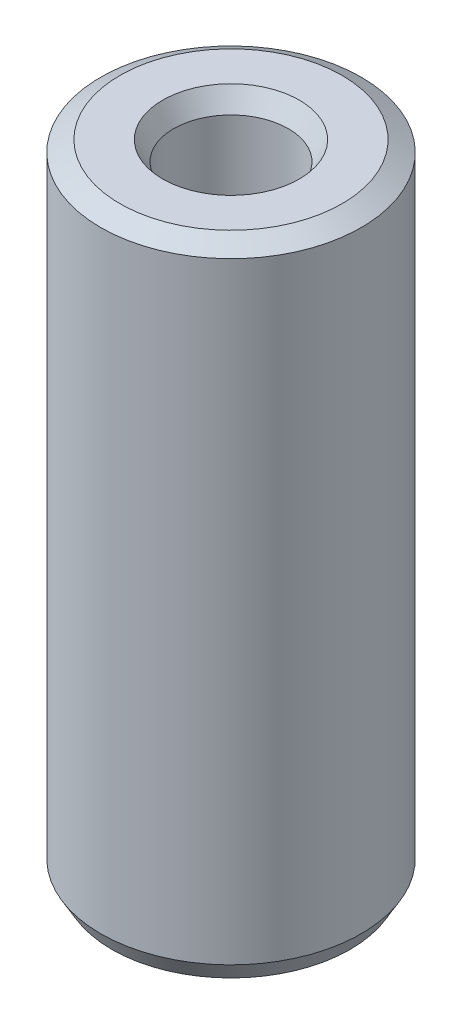
ISO-10303-21;
HEADER;
FILE_DESCRIPTION(('STEP AP214'),'2;1');
FILE_NAME('part.step','',(''),(''),'','','');
FILE_SCHEMA(('AUTOMOTIVE_DESIGN { 1 0 10303 214 1 1 1 1 }'));
ENDSEC;
DATA;
#1=APPLICATION_CONTEXT('core data for automotive mechanical design processes');
#2=APPLICATION_PROTOCOL_DEFINITION('international standard','automotive_design',2000,#1);
#3=PRODUCT_CONTEXT('',#1,'mechanical');
#4=PRODUCT('Part','Part','',(#3));
#5=PRODUCT_RELATED_PRODUCT_CATEGORY('part','',(#4));
#6=PRODUCT_DEFINITION_FORMATION('','',#4);
#7=PRODUCT_DEFINITION_CONTEXT('part definition',#1,'design');
#8=PRODUCT_DEFINITION('design','',#6,#7);
#9=PRODUCT_DEFINITION_SHAPE('','',#8);
#10=(LENGTH_UNIT() NAMED_UNIT(*) SI_UNIT(.MILLI.,.METRE.));
#11=(NAMED_UNIT(*) PLANE_ANGLE_UNIT() SI_UNIT($,.RADIAN.));
#12=(NAMED_UNIT(*) SI_UNIT($,.STERADIAN.) SOLID_ANGLE_UNIT());
#13=UNCERTAINTY_MEASURE_WITH_UNIT(LENGTH_MEASURE(1.E-05),#10,'distance_accuracy_value','');
#14=(GEOMETRIC_REPRESENTATION_CONTEXT(3) GLOBAL_UNCERTAINTY_ASSIGNED_CONTEXT((#13)) GLOBAL_UNIT_ASSIGNED_CONTEXT((#10,
#11,#12)) REPRESENTATION_CONTEXT('',''));
#15=CARTESIAN_POINT('',(0.,0.,0.));
#16=DIRECTION('',(0.,0.,1.));
#17=DIRECTION('',(1.,0.,0.));
#18=AXIS2_PLACEMENT_3D('',#15,#16,#17);
#19=CARTESIAN_POINT('',(0.,197.049070375848,0.));
#20=DIRECTION('',(0.,-1.,0.));
#21=DIRECTION('',(0.,0.,-1.));
#22=AXIS2_PLACEMENT_3D('',#19,#20,#21);
#23=CYLINDRICAL_SURFACE('',#22,40.);
#24=CARTESIAN_POINT('',(0.,5.88731716795488,0.));
#25=DIRECTION('',(0.,1.,0.));
#26=DIRECTION('',(0.,0.,1.));
#27=AXIS2_PLACEMENT_3D('',#24,#25,#26);
#28=CIRCLE('',#27,40.);
#29=CARTESIAN_POINT('',(0.,5.88731716795485,-40.));
#30=VERTEX_POINT('',#29);
#31=EDGE_CURVE('E10',#30,#30,#28,.T.);
#32=CARTESIAN_POINT('',(0.,193.650026224125,0.));
#33=DIRECTION('',(0.,1.,0.));
#34=DIRECTION('',(0.,0.,1.));
#35=AXIS2_PLACEMENT_3D('',#32,#33,#34);
#36=CIRCLE('',#35,40.);
#37=CARTESIAN_POINT('',(0.,193.650026224125,-40.));
#38=VERTEX_POINT('',#37);
#39=EDGE_CURVE('E50',#38,#38,#36,.F.);
#40=CARTESIAN_POINT('',(0.,5.88731716795485,-40.));
#41=CARTESIAN_POINT('',(0.,7.84317872062329,-40.));
#42=CARTESIAN_POINT('',(0.,9.79904027329173,-40.));
#43=CARTESIAN_POINT('',(0.,13.7107633786286,-40.));
#44=CARTESIAN_POINT('',(0.,15.6666249312971,-40.));
#45=CARTESIAN_POINT('',(0.,19.5783480366339,-40.));
#46=CARTESIAN_POINT('',(0.,21.5342095893024,-40.));
#47=CARTESIAN_POINT('',(0.,25.4459326946393,-40.));
#48=CARTESIAN_POINT('',(0.,27.4017942473077,-40.));
#49=CARTESIAN_POINT('',(0.,31.3135173526446,-40.));
#50=CARTESIAN_POINT('',(0.,33.269378905313,-40.));
#51=CARTESIAN_POINT('',(0.,37.1811020106499,-40.));
#52=CARTESIAN_POINT('',(0.,39.1369635633184,-40.));
#53=CARTESIAN_POINT('',(0.,43.0486866686552,-40.));
#54=CARTESIAN_POINT('',(0.,45.0045482213237,-40.));
#55=CARTESIAN_POINT('',(0.,48.9162713266605,-40.));
#56=CARTESIAN_POINT('',(0.,50.872132879329,-40.));
#57=CARTESIAN_POINT('',(0.,54.7838559846659,-40.));
#58=CARTESIAN_POINT('',(0.,56.7397175373343,-40.));
#59=CARTESIAN_POINT('',(0.,60.6514406426712,-40.));
#60=CARTESIAN_POINT('',(0.,62.6073021953396,-40.));
#61=CARTESIAN_POINT('',(0.,66.5190253006765,-40.));
#62=CARTESIAN_POINT('',(0.,68.474886853345,-40.));
#63=CARTESIAN_POINT('',(0.,72.3866099586818,-40.));
#64=CARTESIAN_POINT('',(0.,74.3424715113503,-40.));
#65=CARTESIAN_POINT('',(0.,78.2541946166872,-40.));
#66=CARTESIAN_POINT('',(0.,80.2100561693556,-40.));
#67=CARTESIAN_POINT('',(0.,84.1217792746925,-40.));
#68=CARTESIAN_POINT('',(0.,86.0776408273609,-40.));
#69=CARTESIAN_POINT('',(0.,89.9893639326978,-40.));
#70=CARTESIAN_POINT('',(0.,91.9452254853662,-40.));
#71=CARTESIAN_POINT('',(0.,95.8569485907031,-40.));
#72=CARTESIAN_POINT('',(0.,97.8128101433716,-40.));
#73=CARTESIAN_POINT('',(0.,101.724533248708,-40.));
#74=CARTESIAN_POINT('',(0.,103.680394801377,-40.));
#75=CARTESIAN_POINT('',(0.,107.592117906714,-40.));
#76=CARTESIAN_POINT('',(0.,109.547979459382,-40.));
#77=CARTESIAN_POINT('',(0.,113.459702564719,-40.));
#78=CARTESIAN_POINT('',(0.,115.415564117388,-40.));
#79=CARTESIAN_POINT('',(0.,119.327287222724,-40.));
#80=CARTESIAN_POINT('',(0.,121.283148775393,-40.));
#81=CARTESIAN_POINT('',(0.,125.19487188073,-40.));
#82=CARTESIAN_POINT('',(0.,127.150733433398,-40.));
#83=CARTESIAN_POINT('',(0.,131.062456538735,-40.));
#84=CARTESIAN_POINT('',(0.,133.018318091404,-40.));
#85=CARTESIAN_POINT('',(0.,136.93004119674,-40.));
#86=CARTESIAN_POINT('',(0.,138.885902749409,-40.));
#87=CARTESIAN_POINT('',(0.,142.797625854746,-40.));
#88=CARTESIAN_POINT('',(0.,144.753487407414,-40.));
#89=CARTESIAN_POINT('',(0.,148.665210512751,-40.));
#90=CARTESIAN_POINT('',(0.,150.621072065419,-40.));
#91=CARTESIAN_POINT('',(0.,154.532795170756,-40.));
#92=CARTESIAN_POINT('',(0.,156.488656723425,-40.));
#93=CARTESIAN_POINT('',(0.,160.400379828762,-40.));
#94=CARTESIAN_POINT('',(0.,162.35624138143,-40.));
#95=CARTESIAN_POINT('',(0.,166.267964486767,-40.));
#96=CARTESIAN_POINT('',(0.,168.223826039435,-40.));
#97=CARTESIAN_POINT('',(0.,172.135549144772,-40.));
#98=CARTESIAN_POINT('',(0.,174.091410697441,-40.));
#99=CARTESIAN_POINT('',(0.,178.003133802778,-40.));
#100=CARTESIAN_POINT('',(0.,179.958995355446,-40.));
#101=CARTESIAN_POINT('',(0.,183.870718460783,-40.));
#102=CARTESIAN_POINT('',(0.,185.826580013451,-40.));
#103=CARTESIAN_POINT('',(0.,189.738303118788,-40.));
#104=CARTESIAN_POINT('',(0.,191.694164671457,-40.));
#105=CARTESIAN_POINT('',(0.,193.650026224125,-40.));
#106=B_SPLINE_CURVE_WITH_KNOTS('',3,(#40,#41,#42,#43,#44,#45,#46,#47,#48,#49,#50,#51,#52,#53,
#54,#55,#56,#57,#58,#59,#60,#61,#62,#63,#64,#65,#66,#67,#68,#69,#70,#71,#72,#73,#74,#75,#76,#77,
#78,#79,#80,#81,#82,#83,#84,#85,#86,#87,#88,#89,#90,#91,#92,#93,#94,#95,#96,#97,#98,#99,#100,
#101,#102,#103,#104,#105),.UNSPECIFIED.,.F.,.F.,(4,2,2,2,2,2,2,2,2,2,2,2,2,2,2,2,2,2,2,2,2,2,2,
2,2,2,2,2,2,2,2,2,4),(0.,5.86758465800533,11.7351693160107,17.602753974016,23.4703386320213,
29.3379232900266,35.205507948032,41.0730926060373,46.9406772640426,52.8082619220479,
58.6758465800532,64.5434312380586,70.4110158960639,76.2786005540692,82.1461852120745,
88.0137698700798,93.8813545280852,99.7489391860905,105.616523844096,111.484108502101,
117.351693160106,123.219277818112,129.086862476117,134.954447134122,140.822031792128,
146.689616450133,152.557201108138,158.424785766144,164.292370424149,170.159955082154,
176.02753974016,181.895124398165,187.76270905617),.UNSPECIFIED.);
#107=EDGE_CURVE('BSEAM39',#30,#38,#106,.T.);
#108=ORIENTED_EDGE('',*,*,#31,.T.);
#109=ORIENTED_EDGE('',*,*,#39,.T.);
#110=ORIENTED_EDGE('',*,*,#107,.T.);
#111=ORIENTED_EDGE('',*,*,#107,.F.);
#112=EDGE_LOOP('',(#108,#110,#109,#111));
#113=FACE_BOUND('',#112,.T.);
#114=ADVANCED_FACE('F39',(#113),#23,.T.);
#115=CARTESIAN_POINT('',(0.,197.049070375848,0.));
#116=DIRECTION('',(0.,1.,0.));
#117=DIRECTION('',(0.,0.,1.));
#118=AXIS2_PLACEMENT_3D('',#115,#116,#117);
#119=PLANE('',#118);
#120=CARTESIAN_POINT('',(0.,197.049070375848,0.));
#121=DIRECTION('',(0.,1.,0.));
#122=DIRECTION('',(0.,0.,1.));
#123=AXIS2_PLACEMENT_3D('',#120,#121,#122);
#124=CIRCLE('',#123,20.9928139128867);
#125=CARTESIAN_POINT('',(0.,197.049070375848,20.9928139128867));
#126=VERTEX_POINT('',#125);
#127=EDGE_CURVE('E58',#126,#126,#124,.F.);
#128=ORIENTED_EDGE('',*,*,#127,.T.);
#129=EDGE_LOOP('',(#128));
#130=FACE_BOUND('',#129,.T.);
#131=CARTESIAN_POINT('',(0.,197.049070375848,0.));
#132=DIRECTION('',(0.,1.,0.));
#133=DIRECTION('',(0.,0.,1.));
#134=AXIS2_PLACEMENT_3D('',#131,#132,#133);
#135=CIRCLE('',#134,34.1126828320455);
#136=CARTESIAN_POINT('',(0.,197.049070375848,-34.1126828320455));
#137=VERTEX_POINT('',#136);
#138=EDGE_CURVE('E61',#137,#137,#135,.T.);
#139=ORIENTED_EDGE('',*,*,#138,.T.);
#140=EDGE_LOOP('',(#139));
#141=FACE_BOUND('',#140,.T.);
#142=ADVANCED_FACE('F88',(#130,#141),#119,.T.);
#143=CARTESIAN_POINT('',(0.,0.,0.));
#144=DIRECTION('',(0.,1.,0.));
#145=DIRECTION('',(0.,0.,1.));
#146=AXIS2_PLACEMENT_3D('',#143,#144,#145);
#147=PLANE('',#146);
#148=CARTESIAN_POINT('',(0.,0.,0.));
#149=DIRECTION('',(0.,1.,0.));
#150=DIRECTION('',(0.,0.,1.));
#151=AXIS2_PLACEMENT_3D('',#148,#149,#150);
#152=CIRCLE('',#151,23.4810869291178);
#153=CARTESIAN_POINT('',(0.,0.,23.4810869291178));
#154=VERTEX_POINT('',#153);
#155=EDGE_CURVE('E51',#154,#154,#152,.T.);
#156=ORIENTED_EDGE('',*,*,#155,.T.);
#157=EDGE_LOOP('',(#156));
#158=FACE_BOUND('',#157,.T.);
#159=CARTESIAN_POINT('',(0.,0.,0.));
#160=DIRECTION('',(0.,1.,0.));
#161=DIRECTION('',(0.,0.,1.));
#162=AXIS2_PLACEMENT_3D('',#159,#160,#161);
#163=CIRCLE('',#162,36.6009558482765);
#164=CARTESIAN_POINT('',(0.,0.,36.6009558482765));
#165=VERTEX_POINT('',#164);
#166=EDGE_CURVE('E54',#165,#165,#163,.F.);
#167=ORIENTED_EDGE('',*,*,#166,.T.);
#168=EDGE_LOOP('',(#167));
#169=FACE_BOUND('',#168,.T.);
#170=ADVANCED_FACE('F83',(#158,#169),#147,.F.);
#171=CARTESIAN_POINT('',(0.,197.049070375848,0.));
#172=DIRECTION('',(0.,-1.,0.));
#173=DIRECTION('',(0.,0.,-1.));
#174=AXIS2_PLACEMENT_3D('',#171,#172,#173);
#175=CYLINDRICAL_SURFACE('',#174,17.5937697611632);
#176=CARTESIAN_POINT('',(0.,191.161753207894,0.));
#177=DIRECTION('',(0.,1.,0.));
#178=DIRECTION('',(0.,0.,1.));
#179=AXIS2_PLACEMENT_3D('',#176,#177,#178);
#180=CIRCLE('',#179,17.5937697611632);
#181=CARTESIAN_POINT('',(0.,191.161753207894,-17.5937697611632));
#182=VERTEX_POINT('',#181);
#183=EDGE_CURVE('E67',#182,#182,#180,.T.);
#184=CARTESIAN_POINT('',(0.,3.39904415172332,0.));
#185=DIRECTION('',(0.,1.,0.));
#186=DIRECTION('',(0.,0.,1.));
#187=AXIS2_PLACEMENT_3D('',#184,#185,#186);
#188=CIRCLE('',#187,17.5937697611632);
#189=CARTESIAN_POINT('',(0.,3.39904415172329,-17.5937697611632));
#190=VERTEX_POINT('',#189);
#191=EDGE_CURVE('E69',#190,#190,#188,.F.);
#192=CARTESIAN_POINT('',(0.,191.161753207894,-17.5937697611632));
#193=CARTESIAN_POINT('',(0.,189.205891655225,-17.5937697611632));
#194=CARTESIAN_POINT('',(0.,187.250030102557,-17.5937697611632));
#195=CARTESIAN_POINT('',(0.,183.33830699722,-17.5937697611632));
#196=CARTESIAN_POINT('',(0.,181.382445444551,-17.5937697611632));
#197=CARTESIAN_POINT('',(0.,177.470722339215,-17.5937697611632));
#198=CARTESIAN_POINT('',(0.,175.514860786546,-17.5937697611632));
#199=CARTESIAN_POINT('',(0.,171.603137681209,-17.5937697611632));
#200=CARTESIAN_POINT('',(0.,169.647276128541,-17.5937697611632));
#201=CARTESIAN_POINT('',(0.,165.735553023204,-17.5937697611632));
#202=CARTESIAN_POINT('',(0.,163.779691470535,-17.5937697611632));
#203=CARTESIAN_POINT('',(0.,159.867968365199,-17.5937697611632));
#204=CARTESIAN_POINT('',(0.,157.91210681253,-17.5937697611632));
#205=CARTESIAN_POINT('',(0.,154.000383707193,-17.5937697611632));
#206=CARTESIAN_POINT('',(0.,152.044522154525,-17.5937697611632));
#207=CARTESIAN_POINT('',(0.,148.132799049188,-17.5937697611632));
#208=CARTESIAN_POINT('',(0.,146.176937496519,-17.5937697611632));
#209=CARTESIAN_POINT('',(0.,142.265214391183,-17.5937697611632));
#210=CARTESIAN_POINT('',(0.,140.309352838514,-17.5937697611632));
#211=CARTESIAN_POINT('',(0.,136.397629733177,-17.5937697611632));
#212=CARTESIAN_POINT('',(0.,134.441768180509,-17.5937697611632));
#213=CARTESIAN_POINT('',(0.,130.530045075172,-17.5937697611632));
#214=CARTESIAN_POINT('',(0.,128.574183522504,-17.5937697611632));
#215=CARTESIAN_POINT('',(0.,124.662460417167,-17.5937697611632));
#216=CARTESIAN_POINT('',(0.,122.706598864498,-17.5937697611632));
#217=CARTESIAN_POINT('',(0.,118.794875759161,-17.5937697611632));
#218=CARTESIAN_POINT('',(0.,116.839014206493,-17.5937697611632));
#219=CARTESIAN_POINT('',(0.,112.927291101156,-17.5937697611632));
#220=CARTESIAN_POINT('',(0.,110.971429548488,-17.5937697611632));
#221=CARTESIAN_POINT('',(0.,107.059706443151,-17.5937697611632));
#222=CARTESIAN_POINT('',(0.,105.103844890482,-17.5937697611632));
#223=CARTESIAN_POINT('',(0.,101.192121785145,-17.5937697611632));
#224=CARTESIAN_POINT('',(0.,99.2362602324769,-17.5937697611632));
#225=CARTESIAN_POINT('',(0.,95.32453712714,-17.5937697611632));
#226=CARTESIAN_POINT('',(0.,93.3686755744716,-17.5937697611632));
#227=CARTESIAN_POINT('',(0.,89.4569524691347,-17.5937697611632));
#228=CARTESIAN_POINT('',(0.,87.5010909164663,-17.5937697611632));
#229=CARTESIAN_POINT('',(0.,83.5893678111294,-17.5937697611632));
#230=CARTESIAN_POINT('',(0.,81.6335062584609,-17.5937697611632));
#231=CARTESIAN_POINT('',(0.,77.7217831531241,-17.5937697611632));
#232=CARTESIAN_POINT('',(0.,75.7659216004556,-17.5937697611632));
#233=CARTESIAN_POINT('',(0.,71.8541984951187,-17.5937697611632));
#234=CARTESIAN_POINT('',(0.,69.8983369424503,-17.5937697611632));
#235=CARTESIAN_POINT('',(0.,65.9866138371134,-17.5937697611632));
#236=CARTESIAN_POINT('',(0.,64.030752284445,-17.5937697611632));
#237=CARTESIAN_POINT('',(0.,60.1190291791081,-17.5937697611632));
#238=CARTESIAN_POINT('',(0.,58.1631676264396,-17.5937697611632));
#239=CARTESIAN_POINT('',(0.,54.2514445211028,-17.5937697611632));
#240=CARTESIAN_POINT('',(0.,52.2955829684343,-17.5937697611632));
#241=CARTESIAN_POINT('',(0.,48.3838598630974,-17.5937697611632));
#242=CARTESIAN_POINT('',(0.,46.427998310429,-17.5937697611632));
#243=CARTESIAN_POINT('',(0.,42.5162752050921,-17.5937697611632));
#244=CARTESIAN_POINT('',(0.,40.5604136524237,-17.5937697611632));
#245=CARTESIAN_POINT('',(0.,36.6486905470868,-17.5937697611632));
#246=CARTESIAN_POINT('',(0.,34.6928289944184,-17.5937697611632));
#247=CARTESIAN_POINT('',(0.,30.7811058890815,-17.5937697611632));
#248=CARTESIAN_POINT('',(0.,28.825244336413,-17.5937697611632));
#249=CARTESIAN_POINT('',(0.,24.9135212310762,-17.5937697611632));
#250=CARTESIAN_POINT('',(0.,22.9576596784077,-17.5937697611632));
#251=CARTESIAN_POINT('',(0.,19.0459365730708,-17.5937697611632));
#252=CARTESIAN_POINT('',(0.,17.0900750204024,-17.5937697611632));
#253=CARTESIAN_POINT('',(0.,13.1783519150655,-17.5937697611632));
#254=CARTESIAN_POINT('',(0.,11.2224903623971,-17.5937697611632));
#255=CARTESIAN_POINT('',(0.,7.31076725706017,-17.5937697611632));
#256=CARTESIAN_POINT('',(0.,5.35490570439173,-17.5937697611632));
#257=CARTESIAN_POINT('',(0.,3.39904415172329,-17.5937697611632));
#258=B_SPLINE_CURVE_WITH_KNOTS('',3,(#192,#193,#194,#195,#196,#197,#198,#199,#200,#201,#202,
#203,#204,#205,#206,#207,#208,#209,#210,#211,#212,#213,#214,#215,#216,#217,#218,#219,#220,#221,
#222,#223,#224,#225,#226,#227,#228,#229,#230,#231,#232,#233,#234,#235,#236,#237,#238,#239,#240,
#241,#242,#243,#244,#245,#246,#247,#248,#249,#250,#251,#252,#253,#254,#255,#256,#257),
.UNSPECIFIED.,.F.,.F.,(4,2,2,2,2,2,2,2,2,2,2,2,2,2,2,2,2,2,2,2,2,2,2,2,2,2,2,2,2,2,2,2,4),(0.,
5.8675846580053,11.7351693160106,17.602753974016,23.4703386320213,29.3379232900266,
35.2055079480319,41.0730926060372,46.9406772640426,52.8082619220479,58.6758465800532,
64.5434312380585,70.4110158960639,76.2786005540692,82.1461852120745,88.0137698700798,
93.8813545280851,99.7489391860905,105.616523844096,111.484108502101,117.351693160106,
123.219277818112,129.086862476117,134.954447134122,140.822031792128,146.689616450133,
152.557201108138,158.424785766144,164.292370424149,170.159955082154,176.02753974016,
181.895124398165,187.76270905617),.UNSPECIFIED.);
#259=EDGE_CURVE('BSEAM71',#182,#190,#258,.T.);
#260=ORIENTED_EDGE('',*,*,#183,.T.);
#261=ORIENTED_EDGE('',*,*,#191,.T.);
#262=ORIENTED_EDGE('',*,*,#259,.T.);
#263=ORIENTED_EDGE('',*,*,#259,.F.);
#264=EDGE_LOOP('',(#260,#262,#261,#263));
#265=FACE_BOUND('',#264,.T.);
#266=ADVANCED_FACE('F71',(#265),#175,.F.);
#267=CARTESIAN_POINT('',(0.,191.161753207894,0.));
#268=DIRECTION('',(0.,1.,0.));
#269=DIRECTION('',(0.,0.,1.));
#270=AXIS2_PLACEMENT_3D('',#267,#268,#269);
#271=CONICAL_SURFACE('',#270,17.5937697611632,0.523598775598299);
#272=ORIENTED_EDGE('',*,*,#127,.F.);
#273=EDGE_LOOP('',(#272));
#274=FACE_BOUND('',#273,.T.);
#275=ORIENTED_EDGE('',*,*,#183,.F.);
#276=EDGE_LOOP('',(#275));
#277=FACE_BOUND('',#276,.T.);
#278=ADVANCED_FACE('F77',(#274,#277),#271,.F.);
#279=CARTESIAN_POINT('',(0.,0.,0.));
#280=DIRECTION('',(0.,-1.,0.));
#281=DIRECTION('',(0.,0.,-1.));
#282=AXIS2_PLACEMENT_3D('',#279,#280,#281);
#283=CONICAL_SURFACE('',#282,23.4810869291178,1.04719755119659);
#284=ORIENTED_EDGE('',*,*,#191,.F.);
#285=EDGE_LOOP('',(#284));
#286=FACE_BOUND('',#285,.T.);
#287=ORIENTED_EDGE('',*,*,#155,.F.);
#288=EDGE_LOOP('',(#287));
#289=FACE_BOUND('',#288,.T.);
#290=ADVANCED_FACE('F73',(#286,#289),#283,.F.);
#291=CARTESIAN_POINT('',(0.,5.88731716795488,0.));
#292=DIRECTION('',(0.,1.,0.));
#293=DIRECTION('',(0.,0.,1.));
#294=AXIS2_PLACEMENT_3D('',#291,#292,#293);
#295=CONICAL_SURFACE('',#294,40.,0.523598775598303);
#296=ORIENTED_EDGE('',*,*,#166,.F.);
#297=EDGE_LOOP('',(#296));
#298=FACE_BOUND('',#297,.T.);
#299=ORIENTED_EDGE('',*,*,#31,.F.);
#300=EDGE_LOOP('',(#299));
#301=FACE_BOUND('',#300,.T.);
#302=ADVANCED_FACE('F76',(#298,#301),#295,.T.);
#303=CARTESIAN_POINT('',(0.,197.049070375848,0.));
#304=DIRECTION('',(0.,-1.,0.));
#305=DIRECTION('',(0.,0.,-1.));
#306=AXIS2_PLACEMENT_3D('',#303,#304,#305);
#307=CONICAL_SURFACE('',#306,34.1126828320455,1.04719755119659);
#308=CARTESIAN_POINT('',(0.,193.650026224125,-40.));
#309=CARTESIAN_POINT('',(0.,193.685432934039,-39.9386737795005));
#310=CARTESIAN_POINT('',(0.,193.720839643953,-39.877347559001));
#311=CARTESIAN_POINT('',(0.,193.79165306378,-39.7546951180019));
#312=CARTESIAN_POINT('',(0.,193.827059773694,-39.6933688975024));
#313=CARTESIAN_POINT('',(0.,193.897873193522,-39.5707164565033));
#314=CARTESIAN_POINT('',(0.,193.933279903435,-39.5093902360038));
#315=CARTESIAN_POINT('',(0.,194.004093323263,-39.3867377950048));
#316=CARTESIAN_POINT('',(0.,194.039500033177,-39.3254115745052));
#317=CARTESIAN_POINT('',(0.,194.110313453004,-39.2027591335062));
#318=CARTESIAN_POINT('',(0.,194.145720162918,-39.1414329130067));
#319=CARTESIAN_POINT('',(0.,194.216533582746,-39.0187804720076));
#320=CARTESIAN_POINT('',(0.,194.25194029266,-38.9574542515081));
#321=CARTESIAN_POINT('',(0.,194.322753712487,-38.834801810509));
#322=CARTESIAN_POINT('',(0.,194.358160422401,-38.7734755900095));
#323=CARTESIAN_POINT('',(0.,194.428973842228,-38.6508231490105));
#324=CARTESIAN_POINT('',(0.,194.464380552142,-38.5894969285109));
#325=CARTESIAN_POINT('',(0.,194.53519397197,-38.4668444875119));
#326=CARTESIAN_POINT('',(0.,194.570600681884,-38.4055182670124));
#327=CARTESIAN_POINT('',(0.,194.641414101711,-38.2828658260133));
#328=CARTESIAN_POINT('',(0.,194.676820811625,-38.2215396055138));
#329=CARTESIAN_POINT('',(0.,194.747634231452,-38.0988871645147));
#330=CARTESIAN_POINT('',(0.,194.783040941366,-38.0375609440152));
#331=CARTESIAN_POINT('',(0.,194.853854361194,-37.9149085030162));
#332=CARTESIAN_POINT('',(0.,194.889261071108,-37.8535822825166));
#333=CARTESIAN_POINT('',(0.,194.960074490935,-37.7309298415176));
#334=CARTESIAN_POINT('',(0.,194.995481200849,-37.669603621018));
#335=CARTESIAN_POINT('',(0.,195.066294620677,-37.546951180019));
#336=CARTESIAN_POINT('',(0.,195.10170133059,-37.4856249595195));
#337=CARTESIAN_POINT('',(0.,195.172514750418,-37.3629725185204));
#338=CARTESIAN_POINT('',(0.,195.207921460332,-37.3016462980209));
#339=CARTESIAN_POINT('',(0.,195.278734880159,-37.1789938570218));
#340=CARTESIAN_POINT('',(0.,195.314141590073,-37.1176676365223));
#341=CARTESIAN_POINT('',(0.,195.384955009901,-36.9950151955233));
#342=CARTESIAN_POINT('',(0.,195.420361719814,-36.9336889750237));
#343=CARTESIAN_POINT('',(0.,195.491175139642,-36.8110365340247));
#344=CARTESIAN_POINT('',(0.,195.526581849556,-36.7497103135252));
#345=CARTESIAN_POINT('',(0.,195.597395269383,-36.6270578725261));
#346=CARTESIAN_POINT('',(0.,195.632801979297,-36.5657316520266));
#347=CARTESIAN_POINT('',(0.,195.703615399125,-36.4430792110275));
#348=CARTESIAN_POINT('',(0.,195.739022109038,-36.381752990528));
#349=CARTESIAN_POINT('',(0.,195.809835528866,-36.2591005495289));
#350=CARTESIAN_POINT('',(0.,195.84524223878,-36.1977743290294));
#351=CARTESIAN_POINT('',(0.,195.916055658607,-36.0751218880304));
#352=CARTESIAN_POINT('',(0.,195.951462368521,-36.0137956675309));
#353=CARTESIAN_POINT('',(0.,196.022275788349,-35.8911432265318));
#354=CARTESIAN_POINT('',(0.,196.057682498262,-35.8298170060323));
#355=CARTESIAN_POINT('',(0.,196.12849591809,-35.7071645650332));
#356=CARTESIAN_POINT('',(0.,196.163902628004,-35.6458383445337));
#357=CARTESIAN_POINT('',(0.,196.234716047831,-35.5231859035346));
#358=CARTESIAN_POINT('',(0.,196.270122757745,-35.4618596830351));
#359=CARTESIAN_POINT('',(0.,196.340936177573,-35.3392072420361));
#360=CARTESIAN_POINT('',(0.,196.376342887487,-35.2778810215365));
#361=CARTESIAN_POINT('',(0.,196.447156307314,-35.1552285805375));
#362=CARTESIAN_POINT('',(0.,196.482563017228,-35.093902360038));
#363=CARTESIAN_POINT('',(0.,196.553376437055,-34.9712499190389));
#364=CARTESIAN_POINT('',(0.,196.588783146969,-34.9099236985394));
#365=CARTESIAN_POINT('',(0.,196.659596566797,-34.7872712575403));
#366=CARTESIAN_POINT('',(0.,196.695003276711,-34.7259450370408));
#367=CARTESIAN_POINT('',(0.,196.765816696538,-34.6032925960418));
#368=CARTESIAN_POINT('',(0.,196.801223406452,-34.5419663755422));
#369=CARTESIAN_POINT('',(0.,196.87203682628,-34.4193139345432));
#370=CARTESIAN_POINT('',(0.,196.907443536193,-34.3579877140436));
#371=CARTESIAN_POINT('',(0.,196.978256956021,-34.2353352730446));
#372=CARTESIAN_POINT('',(0.,197.013663665935,-34.1740090525451));
#373=CARTESIAN_POINT('',(0.,197.049070375848,-34.1126828320455));
#374=B_SPLINE_CURVE_WITH_KNOTS('',3,(#308,#309,#310,#311,#312,#313,#314,#315,#316,#317,#318,
#319,#320,#321,#322,#323,#324,#325,#326,#327,#328,#329,#330,#331,#332,#333,#334,#335,#336,#337,
#338,#339,#340,#341,#342,#343,#344,#345,#346,#347,#348,#349,#350,#351,#352,#353,#354,#355,#356,
#357,#358,#359,#360,#361,#362,#363,#364,#365,#366,#367,#368,#369,#370,#371,#372,#373),
.UNSPECIFIED.,.F.,.F.,(4,2,2,2,2,2,2,2,2,2,2,2,2,2,2,2,2,2,2,2,2,2,2,2,2,2,2,2,2,2,2,2,4),(0.,
0.212440259482715,0.424880518965416,0.637320778448111,0.849761037930813,1.06220129741351,
1.27464155689623,1.48708181637892,1.69952207586163,1.91196233534433,2.12440259482702,
2.33684285430974,2.54928311379244,2.76172337327514,2.97416363275783,3.18660389224054,
3.39904415172324,3.61148441120595,3.82392467068865,4.03636493017135,4.24880518965405,
4.46124544913675,4.67368570861946,4.88612596810216,5.09856622758486,5.31100648706756,
5.52344674655026,5.73588700603297,5.94832726551568,6.16076752499837,6.37320778448107,
6.58564804396377,6.79808830344649),.UNSPECIFIED.);
#375=EDGE_CURVE('BSEAM45',#38,#137,#374,.T.);
#376=ORIENTED_EDGE('',*,*,#39,.F.);
#377=ORIENTED_EDGE('',*,*,#138,.F.);
#378=ORIENTED_EDGE('',*,*,#375,.T.);
#379=ORIENTED_EDGE('',*,*,#375,.F.);
#380=EDGE_LOOP('',(#376,#378,#377,#379));
#381=FACE_BOUND('',#380,.T.);
#382=ADVANCED_FACE('F45',(#381),#307,.T.);
#383=CLOSED_SHELL('',(#114,#142,#170,#266,#278,#290,#302,#382));
#384=MANIFOLD_SOLID_BREP('B2',#383);
#385=ADVANCED_BREP_SHAPE_REPRESENTATION('',(#18,#384),#14);
#386=SHAPE_DEFINITION_REPRESENTATION(#9,#385);
ENDSEC;
END-ISO-10303-21;
